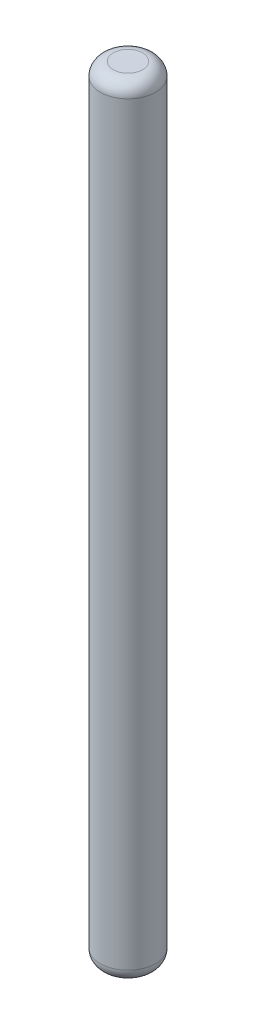
ISO-10303-21;
HEADER;
FILE_DESCRIPTION(('STEP AP214'),'2;1');
FILE_NAME('part.step','',(''),(''),'','','');
FILE_SCHEMA(('AUTOMOTIVE_DESIGN { 1 0 10303 214 1 1 1 1 }'));
ENDSEC;
DATA;
#1=APPLICATION_CONTEXT('core data for automotive mechanical design processes');
#2=APPLICATION_PROTOCOL_DEFINITION('international standard','automotive_design',2000,#1);
#3=PRODUCT_CONTEXT('',#1,'mechanical');
#4=PRODUCT('Part','Part','',(#3));
#5=PRODUCT_RELATED_PRODUCT_CATEGORY('part','',(#4));
#6=PRODUCT_DEFINITION_FORMATION('','',#4);
#7=PRODUCT_DEFINITION_CONTEXT('part definition',#1,'design');
#8=PRODUCT_DEFINITION('design','',#6,#7);
#9=PRODUCT_DEFINITION_SHAPE('','',#8);
#10=(LENGTH_UNIT() NAMED_UNIT(*) SI_UNIT(.MILLI.,.METRE.));
#11=(NAMED_UNIT(*) PLANE_ANGLE_UNIT() SI_UNIT($,.RADIAN.));
#12=(NAMED_UNIT(*) SI_UNIT($,.STERADIAN.) SOLID_ANGLE_UNIT());
#13=UNCERTAINTY_MEASURE_WITH_UNIT(LENGTH_MEASURE(1.E-05),#10,'distance_accuracy_value','');
#14=(GEOMETRIC_REPRESENTATION_CONTEXT(3) GLOBAL_UNCERTAINTY_ASSIGNED_CONTEXT((#13)) GLOBAL_UNIT_ASSIGNED_CONTEXT((#10,
#11,#12)) REPRESENTATION_CONTEXT('',''));
#15=CARTESIAN_POINT('',(0.,0.,0.));
#16=DIRECTION('',(0.,0.,1.));
#17=DIRECTION('',(1.,0.,0.));
#18=AXIS2_PLACEMENT_3D('',#15,#16,#17);
#19=CARTESIAN_POINT('',(0.,60.,0.));
#20=DIRECTION('',(0.,-1.,0.));
#21=DIRECTION('',(0.,0.,-1.));
#22=AXIS2_PLACEMENT_3D('',#19,#20,#21);
#23=CYLINDRICAL_SURFACE('',#22,2.125);
#24=CARTESIAN_POINT('',(0.,1.,0.));
#25=DIRECTION('',(0.,1.,0.));
#26=DIRECTION('',(0.,0.,1.));
#27=AXIS2_PLACEMENT_3D('',#24,#25,#26);
#28=CIRCLE('',#27,2.125);
#29=CARTESIAN_POINT('',(0.,1.,2.125));
#30=VERTEX_POINT('',#29);
#31=EDGE_CURVE('E54',#30,#30,#28,.T.);
#32=ORIENTED_EDGE('',*,*,#31,.T.);
#33=EDGE_LOOP('',(#32));
#34=FACE_BOUND('',#33,.T.);
#35=CARTESIAN_POINT('',(0.,59.,0.));
#36=DIRECTION('',(0.,1.,0.));
#37=DIRECTION('',(0.,0.,1.));
#38=AXIS2_PLACEMENT_3D('',#35,#36,#37);
#39=CIRCLE('',#38,2.125);
#40=CARTESIAN_POINT('',(0.,59.,2.125));
#41=VERTEX_POINT('',#40);
#42=EDGE_CURVE('E59',#41,#41,#39,.F.);
#43=ORIENTED_EDGE('',*,*,#42,.T.);
#44=EDGE_LOOP('',(#43));
#45=FACE_BOUND('',#44,.T.);
#46=ADVANCED_FACE('F41',(#34,#45),#23,.T.);
#47=CARTESIAN_POINT('',(0.,60.,0.));
#48=DIRECTION('',(0.,1.,0.));
#49=DIRECTION('',(0.,0.,1.));
#50=AXIS2_PLACEMENT_3D('',#47,#48,#49);
#51=PLANE('',#50);
#52=CARTESIAN_POINT('',(0.,60.,0.));
#53=DIRECTION('',(0.,1.,0.));
#54=DIRECTION('',(0.,0.,1.));
#55=AXIS2_PLACEMENT_3D('',#52,#53,#54);
#56=CIRCLE('',#55,1.125);
#57=CARTESIAN_POINT('',(0.,60.,1.125));
#58=VERTEX_POINT('',#57);
#59=EDGE_CURVE('E10',#58,#58,#56,.T.);
#60=ORIENTED_EDGE('',*,*,#59,.T.);
#61=EDGE_LOOP('',(#60));
#62=FACE_BOUND('',#61,.T.);
#63=ADVANCED_FACE('F76',(#62),#51,.T.);
#64=CARTESIAN_POINT('',(0.,0.,0.));
#65=DIRECTION('',(0.,1.,0.));
#66=DIRECTION('',(0.,0.,1.));
#67=AXIS2_PLACEMENT_3D('',#64,#65,#66);
#68=PLANE('',#67);
#69=CARTESIAN_POINT('',(0.,0.,0.));
#70=DIRECTION('',(0.,1.,0.));
#71=DIRECTION('',(0.,0.,1.));
#72=AXIS2_PLACEMENT_3D('',#69,#70,#71);
#73=CIRCLE('',#72,1.125);
#74=CARTESIAN_POINT('',(0.,0.,1.125));
#75=VERTEX_POINT('',#74);
#76=EDGE_CURVE('E49',#75,#75,#73,.F.);
#77=ORIENTED_EDGE('',*,*,#76,.T.);
#78=EDGE_LOOP('',(#77));
#79=FACE_BOUND('',#78,.T.);
#80=ADVANCED_FACE('F73',(#79),#68,.F.);
#81=CARTESIAN_POINT('',(0.,1.,0.));
#82=DIRECTION('',(0.,1.,0.));
#83=DIRECTION('',(0.,0.,1.));
#84=AXIS2_PLACEMENT_3D('',#81,#82,#83);
#85=TOROIDAL_SURFACE('',#84,1.125,1.);
#86=ORIENTED_EDGE('',*,*,#76,.F.);
#87=EDGE_LOOP('',(#86));
#88=FACE_BOUND('',#87,.T.);
#89=ORIENTED_EDGE('',*,*,#31,.F.);
#90=EDGE_LOOP('',(#89));
#91=FACE_BOUND('',#90,.T.);
#92=ADVANCED_FACE('F69',(#88,#91),#85,.T.);
#93=CARTESIAN_POINT('',(0.,59.,0.));
#94=DIRECTION('',(0.,1.,0.));
#95=DIRECTION('',(0.,0.,1.));
#96=AXIS2_PLACEMENT_3D('',#93,#94,#95);
#97=TOROIDAL_SURFACE('',#96,1.125,1.);
#98=ORIENTED_EDGE('',*,*,#42,.F.);
#99=EDGE_LOOP('',(#98));
#100=FACE_BOUND('',#99,.T.);
#101=ORIENTED_EDGE('',*,*,#59,.F.);
#102=EDGE_LOOP('',(#101));
#103=FACE_BOUND('',#102,.T.);
#104=ADVANCED_FACE('F43',(#100,#103),#97,.T.);
#105=CLOSED_SHELL('',(#46,#63,#80,#92,#104));
#106=MANIFOLD_SOLID_BREP('B2',#105);
#107=ADVANCED_BREP_SHAPE_REPRESENTATION('',(#18,#106),#14);
#108=SHAPE_DEFINITION_REPRESENTATION(#9,#107);
ENDSEC;
END-ISO-10303-21;
